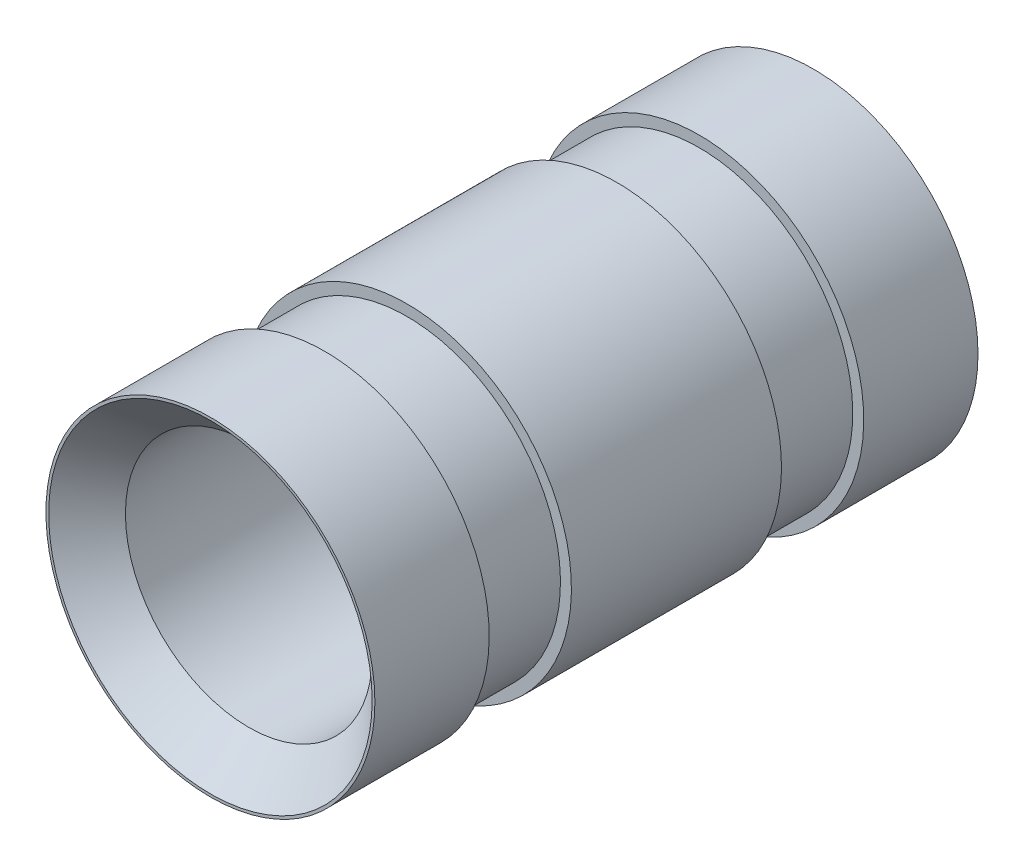
ISO-10303-21;
HEADER;
FILE_DESCRIPTION(('STEP AP214'),'2;1');
FILE_NAME('part.step','',(''),(''),'','','');
FILE_SCHEMA(('AUTOMOTIVE_DESIGN { 1 0 10303 214 1 1 1 1 }'));
ENDSEC;
DATA;
#1=APPLICATION_CONTEXT('core data for automotive mechanical design processes');
#2=APPLICATION_PROTOCOL_DEFINITION('international standard','automotive_design',2000,#1);
#3=PRODUCT_CONTEXT('',#1,'mechanical');
#4=PRODUCT('Part','Part','',(#3));
#5=PRODUCT_RELATED_PRODUCT_CATEGORY('part','',(#4));
#6=PRODUCT_DEFINITION_FORMATION('','',#4);
#7=PRODUCT_DEFINITION_CONTEXT('part definition',#1,'design');
#8=PRODUCT_DEFINITION('design','',#6,#7);
#9=PRODUCT_DEFINITION_SHAPE('','',#8);
#10=(LENGTH_UNIT() NAMED_UNIT(*) SI_UNIT(.MILLI.,.METRE.));
#11=(NAMED_UNIT(*) PLANE_ANGLE_UNIT() SI_UNIT($,.RADIAN.));
#12=(NAMED_UNIT(*) SI_UNIT($,.STERADIAN.) SOLID_ANGLE_UNIT());
#13=UNCERTAINTY_MEASURE_WITH_UNIT(LENGTH_MEASURE(1.E-05),#10,'distance_accuracy_value','');
#14=(GEOMETRIC_REPRESENTATION_CONTEXT(3) GLOBAL_UNCERTAINTY_ASSIGNED_CONTEXT((#13)) GLOBAL_UNIT_ASSIGNED_CONTEXT((#10,
#11,#12)) REPRESENTATION_CONTEXT('',''));
#15=CARTESIAN_POINT('',(0.,0.,0.));
#16=DIRECTION('',(0.,0.,1.));
#17=DIRECTION('',(1.,0.,0.));
#18=AXIS2_PLACEMENT_3D('',#15,#16,#17);
#19=CARTESIAN_POINT('',(0.,0.,69.85));
#20=DIRECTION('',(0.,0.,-1.));
#21=DIRECTION('',(-1.,0.,0.));
#22=AXIS2_PLACEMENT_3D('',#19,#20,#21);
#23=CYLINDRICAL_SURFACE('',#22,38.1);
#24=CARTESIAN_POINT('',(0.,0.,69.85));
#25=DIRECTION('',(0.,0.,1.));
#26=DIRECTION('',(1.,0.,0.));
#27=AXIS2_PLACEMENT_3D('',#24,#25,#26);
#28=CIRCLE('',#27,38.1);
#29=CARTESIAN_POINT('',(38.1,0.,69.85));
#30=VERTEX_POINT('',#29);
#31=EDGE_CURVE('E52',#30,#30,#28,.T.);
#32=ORIENTED_EDGE('',*,*,#31,.F.);
#33=EDGE_LOOP('',(#32));
#34=FACE_BOUND('',#33,.T.);
#35=CARTESIAN_POINT('',(0.,0.,43.3788561936318));
#36=DIRECTION('',(0.,0.,1.));
#37=DIRECTION('',(0.,-1.,0.));
#38=AXIS2_PLACEMENT_3D('',#35,#36,#37);
#39=CIRCLE('',#38,38.1);
#40=CARTESIAN_POINT('',(0.,-38.1,43.3788561936318));
#41=VERTEX_POINT('',#40);
#42=EDGE_CURVE('E64',#41,#41,#39,.T.);
#43=ORIENTED_EDGE('',*,*,#42,.T.);
#44=EDGE_LOOP('',(#43));
#45=FACE_BOUND('',#44,.T.);
#46=ADVANCED_FACE('F40',(#34,#45),#23,.T.);
#47=CARTESIAN_POINT('',(0.,0.,-69.85));
#48=DIRECTION('',(0.,0.,1.));
#49=DIRECTION('',(1.,0.,0.));
#50=AXIS2_PLACEMENT_3D('',#47,#48,#49);
#51=CIRCLE('',#50,38.1);
#52=CARTESIAN_POINT('',(38.1,0.,-69.85));
#53=VERTEX_POINT('',#52);
#54=EDGE_CURVE('E56',#53,#53,#51,.T.);
#55=ORIENTED_EDGE('',*,*,#54,.T.);
#56=EDGE_LOOP('',(#55));
#57=FACE_BOUND('',#56,.T.);
#58=CARTESIAN_POINT('',(0.,0.,-43.3788561936318));
#59=DIRECTION('',(0.,0.,1.));
#60=DIRECTION('',(0.,-1.,0.));
#61=AXIS2_PLACEMENT_3D('',#58,#59,#60);
#62=CIRCLE('',#61,38.1);
#63=CARTESIAN_POINT('',(0.,-38.1,-43.3788561936318));
#64=VERTEX_POINT('',#63);
#65=EDGE_CURVE('E75',#64,#64,#62,.T.);
#66=ORIENTED_EDGE('',*,*,#65,.F.);
#67=EDGE_LOOP('',(#66));
#68=FACE_BOUND('',#67,.T.);
#69=ADVANCED_FACE('F97',(#57,#68),#23,.T.);
#70=CARTESIAN_POINT('',(0.,0.,69.85));
#71=DIRECTION('',(0.,0.,1.));
#72=DIRECTION('',(1.,0.,0.));
#73=AXIS2_PLACEMENT_3D('',#70,#71,#72);
#74=PLANE('',#73);
#75=CARTESIAN_POINT('',(0.,0.,69.85));
#76=DIRECTION('',(0.,0.,1.));
#77=DIRECTION('',(1.,0.,0.));
#78=AXIS2_PLACEMENT_3D('',#75,#76,#77);
#79=CIRCLE('',#78,37.4650000000001);
#80=CARTESIAN_POINT('',(37.4650000000001,0.,69.85));
#81=VERTEX_POINT('',#80);
#82=EDGE_CURVE('E10',#81,#81,#79,.F.);
#83=ORIENTED_EDGE('',*,*,#82,.T.);
#84=EDGE_LOOP('',(#83));
#85=FACE_BOUND('',#84,.T.);
#86=ORIENTED_EDGE('',*,*,#31,.T.);
#87=EDGE_LOOP('',(#86));
#88=FACE_BOUND('',#87,.T.);
#89=ADVANCED_FACE('F110',(#85,#88),#74,.T.);
#90=CARTESIAN_POINT('',(0.,0.,-69.85));
#91=DIRECTION('',(0.,0.,1.));
#92=DIRECTION('',(1.,0.,0.));
#93=AXIS2_PLACEMENT_3D('',#90,#91,#92);
#94=PLANE('',#93);
#95=ORIENTED_EDGE('',*,*,#54,.F.);
#96=EDGE_LOOP('',(#95));
#97=FACE_BOUND('',#96,.T.);
#98=CARTESIAN_POINT('',(0.,0.,-69.85));
#99=DIRECTION('',(0.,0.,1.));
#100=DIRECTION('',(1.,0.,0.));
#101=AXIS2_PLACEMENT_3D('',#98,#99,#100);
#102=CIRCLE('',#101,28.575);
#103=CARTESIAN_POINT('',(28.575,0.,-69.85));
#104=VERTEX_POINT('',#103);
#105=EDGE_CURVE('E60',#104,#104,#102,.T.);
#106=ORIENTED_EDGE('',*,*,#105,.T.);
#107=EDGE_LOOP('',(#106));
#108=FACE_BOUND('',#107,.T.);
#109=ADVANCED_FACE('F122',(#97,#108),#94,.F.);
#110=CARTESIAN_POINT('',(0.,0.,69.85));
#111=DIRECTION('',(0.,0.,-1.));
#112=DIRECTION('',(-1.,0.,0.));
#113=AXIS2_PLACEMENT_3D('',#110,#111,#112);
#114=CYLINDRICAL_SURFACE('',#113,28.575);
#115=CARTESIAN_POINT('',(0.,0.,60.9599999999999));
#116=DIRECTION('',(0.,0.,1.));
#117=DIRECTION('',(1.,0.,0.));
#118=AXIS2_PLACEMENT_3D('',#115,#116,#117);
#119=CIRCLE('',#118,28.575);
#120=CARTESIAN_POINT('',(28.575,0.,60.9599999999999));
#121=VERTEX_POINT('',#120);
#122=EDGE_CURVE('E48',#121,#121,#119,.T.);
#123=ORIENTED_EDGE('',*,*,#122,.T.);
#124=EDGE_LOOP('',(#123));
#125=FACE_BOUND('',#124,.T.);
#126=ORIENTED_EDGE('',*,*,#105,.F.);
#127=EDGE_LOOP('',(#126));
#128=FACE_BOUND('',#127,.T.);
#129=ADVANCED_FACE('F127',(#125,#128),#114,.F.);
#130=CARTESIAN_POINT('',(0.,0.,-24.3288561936318));
#131=DIRECTION('',(0.,0.,-1.));
#132=DIRECTION('',(0.,1.,0.));
#133=AXIS2_PLACEMENT_3D('',#130,#131,#132);
#134=PLANE('',#133);
#135=CARTESIAN_POINT('',(0.,0.,-24.3288561936318));
#136=DIRECTION('',(0.,0.,1.));
#137=DIRECTION('',(0.,-1.,0.));
#138=AXIS2_PLACEMENT_3D('',#135,#136,#137);
#139=CIRCLE('',#138,35.56);
#140=CARTESIAN_POINT('',(0.,-35.56,-24.3288561936318));
#141=VERTEX_POINT('',#140);
#142=EDGE_CURVE('E69',#141,#141,#139,.T.);
#143=ORIENTED_EDGE('',*,*,#142,.T.);
#144=EDGE_LOOP('',(#143));
#145=FACE_BOUND('',#144,.T.);
#146=CARTESIAN_POINT('',(0.,0.,-24.3288561936318));
#147=DIRECTION('',(0.,0.,1.));
#148=DIRECTION('',(0.,-1.,0.));
#149=AXIS2_PLACEMENT_3D('',#146,#147,#148);
#150=CIRCLE('',#149,38.1);
#151=CARTESIAN_POINT('',(0.,-38.1,-24.3288561936318));
#152=VERTEX_POINT('',#151);
#153=EDGE_CURVE('E65',#152,#152,#150,.T.);
#154=ORIENTED_EDGE('',*,*,#153,.F.);
#155=EDGE_LOOP('',(#154));
#156=FACE_BOUND('',#155,.T.);
#157=ADVANCED_FACE('F132',(#145,#156),#134,.T.);
#158=CARTESIAN_POINT('',(0.,0.,69.85));
#159=DIRECTION('',(0.,0.,1.));
#160=DIRECTION('',(0.,-1.,0.));
#161=AXIS2_PLACEMENT_3D('',#158,#159,#160);
#162=CYLINDRICAL_SURFACE('',#161,35.56);
#163=CARTESIAN_POINT('',(0.,0.,-43.3788561936318));
#164=DIRECTION('',(0.,0.,1.));
#165=DIRECTION('',(0.,-1.,0.));
#166=AXIS2_PLACEMENT_3D('',#163,#164,#165);
#167=CIRCLE('',#166,35.56);
#168=CARTESIAN_POINT('',(0.,-35.56,-43.3788561936318));
#169=VERTEX_POINT('',#168);
#170=EDGE_CURVE('E72',#169,#169,#167,.T.);
#171=ORIENTED_EDGE('',*,*,#170,.T.);
#172=EDGE_LOOP('',(#171));
#173=FACE_BOUND('',#172,.T.);
#174=ORIENTED_EDGE('',*,*,#142,.F.);
#175=EDGE_LOOP('',(#174));
#176=FACE_BOUND('',#175,.T.);
#177=ADVANCED_FACE('F105',(#173,#176),#162,.T.);
#178=CARTESIAN_POINT('',(0.,0.,-43.3788561936318));
#179=DIRECTION('',(0.,0.,1.));
#180=DIRECTION('',(0.,-1.,0.));
#181=AXIS2_PLACEMENT_3D('',#178,#179,#180);
#182=PLANE('',#181);
#183=ORIENTED_EDGE('',*,*,#65,.T.);
#184=EDGE_LOOP('',(#183));
#185=FACE_BOUND('',#184,.T.);
#186=ORIENTED_EDGE('',*,*,#170,.F.);
#187=EDGE_LOOP('',(#186));
#188=FACE_BOUND('',#187,.T.);
#189=ADVANCED_FACE('F95',(#185,#188),#182,.T.);
#190=ORIENTED_EDGE('',*,*,#153,.T.);
#191=EDGE_LOOP('',(#190));
#192=FACE_BOUND('',#191,.T.);
#193=CARTESIAN_POINT('',(0.,0.,24.3288561936318));
#194=DIRECTION('',(0.,0.,1.));
#195=DIRECTION('',(0.,-1.,0.));
#196=AXIS2_PLACEMENT_3D('',#193,#194,#195);
#197=CIRCLE('',#196,38.1);
#198=CARTESIAN_POINT('',(0.,-38.1,24.3288561936318));
#199=VERTEX_POINT('',#198);
#200=EDGE_CURVE('E68',#199,#199,#197,.T.);
#201=ORIENTED_EDGE('',*,*,#200,.F.);
#202=EDGE_LOOP('',(#201));
#203=FACE_BOUND('',#202,.T.);
#204=ADVANCED_FACE('F92',(#192,#203),#23,.T.);
#205=CARTESIAN_POINT('',(0.,0.,43.3788561936318));
#206=DIRECTION('',(0.,0.,-1.));
#207=DIRECTION('',(0.,1.,0.));
#208=AXIS2_PLACEMENT_3D('',#205,#206,#207);
#209=PLANE('',#208);
#210=CARTESIAN_POINT('',(0.,0.,43.3788561936318));
#211=DIRECTION('',(0.,0.,1.));
#212=DIRECTION('',(0.,-1.,0.));
#213=AXIS2_PLACEMENT_3D('',#210,#211,#212);
#214=CIRCLE('',#213,35.56);
#215=CARTESIAN_POINT('',(0.,-35.56,43.3788561936318));
#216=VERTEX_POINT('',#215);
#217=EDGE_CURVE('E80',#216,#216,#214,.T.);
#218=ORIENTED_EDGE('',*,*,#217,.T.);
#219=EDGE_LOOP('',(#218));
#220=FACE_BOUND('',#219,.T.);
#221=ORIENTED_EDGE('',*,*,#42,.F.);
#222=EDGE_LOOP('',(#221));
#223=FACE_BOUND('',#222,.T.);
#224=ADVANCED_FACE('F94',(#220,#223),#209,.T.);
#225=CARTESIAN_POINT('',(0.,0.,69.85));
#226=DIRECTION('',(0.,0.,1.));
#227=DIRECTION('',(0.,-1.,0.));
#228=AXIS2_PLACEMENT_3D('',#225,#226,#227);
#229=CYLINDRICAL_SURFACE('',#228,35.56);
#230=CARTESIAN_POINT('',(0.,0.,24.3288561936318));
#231=DIRECTION('',(0.,0.,1.));
#232=DIRECTION('',(0.,-1.,0.));
#233=AXIS2_PLACEMENT_3D('',#230,#231,#232);
#234=CIRCLE('',#233,35.56);
#235=CARTESIAN_POINT('',(0.,-35.56,24.3288561936318));
#236=VERTEX_POINT('',#235);
#237=EDGE_CURVE('E83',#236,#236,#234,.T.);
#238=ORIENTED_EDGE('',*,*,#237,.T.);
#239=EDGE_LOOP('',(#238));
#240=FACE_BOUND('',#239,.T.);
#241=ORIENTED_EDGE('',*,*,#217,.F.);
#242=EDGE_LOOP('',(#241));
#243=FACE_BOUND('',#242,.T.);
#244=ADVANCED_FACE('F102',(#240,#243),#229,.T.);
#245=CARTESIAN_POINT('',(0.,0.,24.3288561936318));
#246=DIRECTION('',(0.,0.,1.));
#247=DIRECTION('',(0.,-1.,0.));
#248=AXIS2_PLACEMENT_3D('',#245,#246,#247);
#249=PLANE('',#248);
#250=ORIENTED_EDGE('',*,*,#200,.T.);
#251=EDGE_LOOP('',(#250));
#252=FACE_BOUND('',#251,.T.);
#253=ORIENTED_EDGE('',*,*,#237,.F.);
#254=EDGE_LOOP('',(#253));
#255=FACE_BOUND('',#254,.T.);
#256=ADVANCED_FACE('F89',(#252,#255),#249,.T.);
#257=CARTESIAN_POINT('',(0.,0.,60.9599999999999));
#258=DIRECTION('',(0.,0.,1.));
#259=DIRECTION('',(1.,0.,0.));
#260=AXIS2_PLACEMENT_3D('',#257,#258,#259);
#261=CONICAL_SURFACE('',#260,28.575,0.785398163397448);
#262=ORIENTED_EDGE('',*,*,#82,.F.);
#263=EDGE_LOOP('',(#262));
#264=FACE_BOUND('',#263,.T.);
#265=ORIENTED_EDGE('',*,*,#122,.F.);
#266=EDGE_LOOP('',(#265));
#267=FACE_BOUND('',#266,.T.);
#268=ADVANCED_FACE('F43',(#264,#267),#261,.F.);
#269=CLOSED_SHELL('',(#46,#69,#89,#109,#129,#157,#177,#189,#204,#224,#244,#256,#268));
#270=MANIFOLD_SOLID_BREP('B2',#269);
#271=ADVANCED_BREP_SHAPE_REPRESENTATION('',(#18,#270),#14);
#272=SHAPE_DEFINITION_REPRESENTATION(#9,#271);
ENDSEC;
END-ISO-10303-21;
